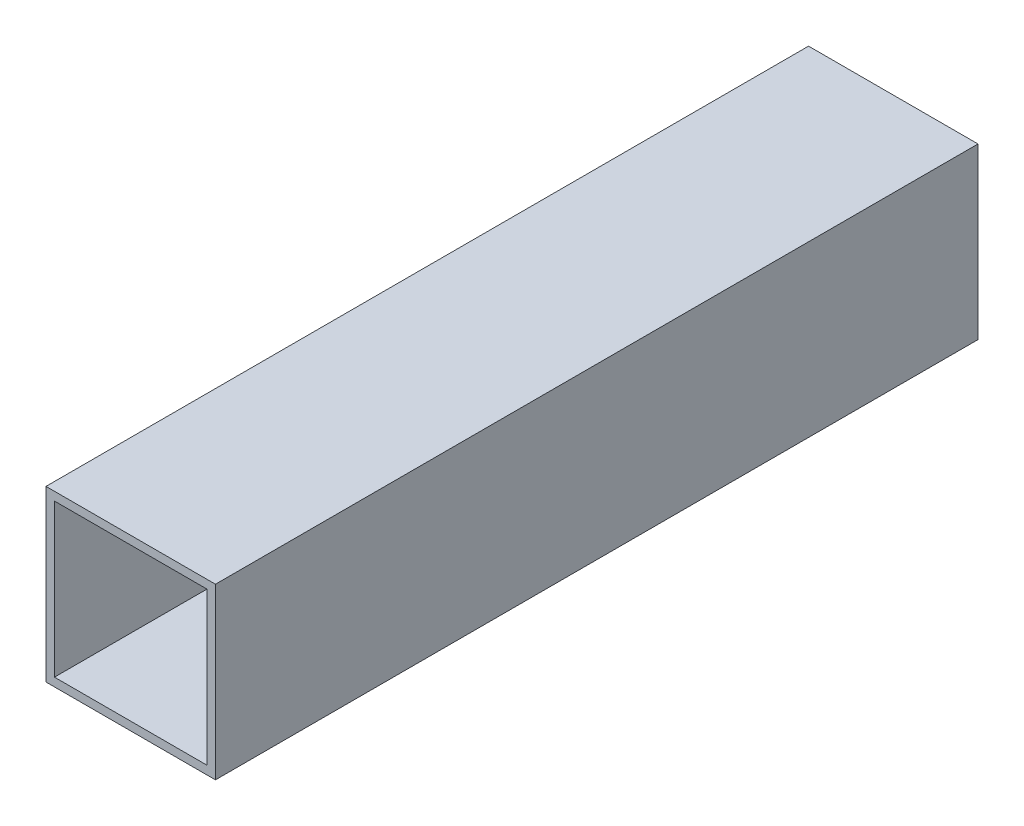
ISO-10303-21;
HEADER;
FILE_DESCRIPTION(('STEP AP214'),'2;1');
FILE_NAME('part.step','',(''),(''),'','','');
FILE_SCHEMA(('AUTOMOTIVE_DESIGN { 1 0 10303 214 1 1 1 1 }'));
ENDSEC;
DATA;
#1=APPLICATION_CONTEXT('core data for automotive mechanical design processes');
#2=APPLICATION_PROTOCOL_DEFINITION('international standard','automotive_design',2000,#1);
#3=PRODUCT_CONTEXT('',#1,'mechanical');
#4=PRODUCT('Part','Part','',(#3));
#5=PRODUCT_RELATED_PRODUCT_CATEGORY('part','',(#4));
#6=PRODUCT_DEFINITION_FORMATION('','',#4);
#7=PRODUCT_DEFINITION_CONTEXT('part definition',#1,'design');
#8=PRODUCT_DEFINITION('design','',#6,#7);
#9=PRODUCT_DEFINITION_SHAPE('','',#8);
#10=(LENGTH_UNIT() NAMED_UNIT(*) SI_UNIT(.MILLI.,.METRE.));
#11=(NAMED_UNIT(*) PLANE_ANGLE_UNIT() SI_UNIT($,.RADIAN.));
#12=(NAMED_UNIT(*) SI_UNIT($,.STERADIAN.) SOLID_ANGLE_UNIT());
#13=UNCERTAINTY_MEASURE_WITH_UNIT(LENGTH_MEASURE(1.E-05),#10,'distance_accuracy_value','');
#14=(GEOMETRIC_REPRESENTATION_CONTEXT(3) GLOBAL_UNCERTAINTY_ASSIGNED_CONTEXT((#13)) GLOBAL_UNIT_ASSIGNED_CONTEXT((#10,
#11,#12)) REPRESENTATION_CONTEXT('',''));
#15=CARTESIAN_POINT('',(0.,0.,0.));
#16=DIRECTION('',(0.,0.,1.));
#17=DIRECTION('',(1.,0.,0.));
#18=AXIS2_PLACEMENT_3D('',#15,#16,#17);
#19=CARTESIAN_POINT('',(0.,0.,225.));
#20=DIRECTION('',(0.,0.,-1.));
#21=DIRECTION('',(-1.,0.,0.));
#22=AXIS2_PLACEMENT_3D('',#19,#20,#21);
#23=PLANE('',#22);
#24=DIRECTION('',(0.,-1.,0.));
#25=VECTOR('',#24,1.);
#26=CARTESIAN_POINT('',(-50.,-50.,225.));
#27=LINE('',#26,#25);
#28=CARTESIAN_POINT('',(-50.,49.9999999999999,225.));
#29=VERTEX_POINT('',#28);
#30=CARTESIAN_POINT('',(-50.,-50.,225.));
#31=VERTEX_POINT('',#30);
#32=EDGE_CURVE('E149',#29,#31,#27,.T.);
#33=ORIENTED_EDGE('',*,*,#32,.T.);
#34=DIRECTION('',(1.,0.,0.));
#35=VECTOR('',#34,1.);
#36=CARTESIAN_POINT('',(-50.,-50.,225.));
#37=LINE('',#36,#35);
#38=CARTESIAN_POINT('',(50.,-50.,225.));
#39=VERTEX_POINT('',#38);
#40=EDGE_CURVE('E152',#31,#39,#37,.T.);
#41=ORIENTED_EDGE('',*,*,#40,.T.);
#42=DIRECTION('',(0.,1.,0.));
#43=VECTOR('',#42,1.);
#44=CARTESIAN_POINT('',(50.,-50.,225.));
#45=LINE('',#44,#43);
#46=CARTESIAN_POINT('',(49.9999999999999,49.9999999999999,225.));
#47=VERTEX_POINT('',#46);
#48=EDGE_CURVE('E155',#39,#47,#45,.T.);
#49=ORIENTED_EDGE('',*,*,#48,.T.);
#50=DIRECTION('',(-1.,0.,0.));
#51=VECTOR('',#50,1.);
#52=CARTESIAN_POINT('',(-50.,49.9999999999999,225.));
#53=LINE('',#52,#51);
#54=EDGE_CURVE('E158',#47,#29,#53,.T.);
#55=ORIENTED_EDGE('',*,*,#54,.T.);
#56=EDGE_LOOP('',(#33,#41,#49,#55));
#57=FACE_BOUND('',#56,.T.);
#58=DIRECTION('',(0.,-1.,0.));
#59=VECTOR('',#58,1.);
#60=CARTESIAN_POINT('',(-45.,-45.,225.));
#61=LINE('',#60,#59);
#62=CARTESIAN_POINT('',(-45.,44.9999999999999,225.));
#63=VERTEX_POINT('',#62);
#64=CARTESIAN_POINT('',(-45.,-45.,225.));
#65=VERTEX_POINT('',#64);
#66=EDGE_CURVE('E106',#63,#65,#61,.T.);
#67=ORIENTED_EDGE('',*,*,#66,.F.);
#68=DIRECTION('',(-1.,0.,0.));
#69=VECTOR('',#68,1.);
#70=CARTESIAN_POINT('',(-45.,44.9999999999999,225.));
#71=LINE('',#70,#69);
#72=CARTESIAN_POINT('',(45.,44.9999999999999,225.));
#73=VERTEX_POINT('',#72);
#74=EDGE_CURVE('E134',#73,#63,#71,.T.);
#75=ORIENTED_EDGE('',*,*,#74,.F.);
#76=DIRECTION('',(0.,1.,0.));
#77=VECTOR('',#76,1.);
#78=CARTESIAN_POINT('',(45.,-45.,225.));
#79=LINE('',#78,#77);
#80=CARTESIAN_POINT('',(45.,-45.,225.));
#81=VERTEX_POINT('',#80);
#82=EDGE_CURVE('E128',#81,#73,#79,.T.);
#83=ORIENTED_EDGE('',*,*,#82,.F.);
#84=DIRECTION('',(1.,0.,0.));
#85=VECTOR('',#84,1.);
#86=CARTESIAN_POINT('',(-45.,-45.,225.));
#87=LINE('',#86,#85);
#88=EDGE_CURVE('E115',#65,#81,#87,.T.);
#89=ORIENTED_EDGE('',*,*,#88,.F.);
#90=EDGE_LOOP('',(#67,#75,#83,#89));
#91=FACE_BOUND('',#90,.T.);
#92=ADVANCED_FACE('F37',(#57,#91),#23,.F.);
#93=CARTESIAN_POINT('',(0.,0.,-225.));
#94=DIRECTION('',(0.,0.,-1.));
#95=DIRECTION('',(-1.,0.,0.));
#96=AXIS2_PLACEMENT_3D('',#93,#94,#95);
#97=PLANE('',#96);
#98=DIRECTION('',(0.,-1.,0.));
#99=VECTOR('',#98,1.);
#100=CARTESIAN_POINT('',(-50.,-50.,-225.));
#101=LINE('',#100,#99);
#102=CARTESIAN_POINT('',(-50.,49.9999999999999,-225.));
#103=VERTEX_POINT('',#102);
#104=CARTESIAN_POINT('',(-50.,-50.,-225.));
#105=VERTEX_POINT('',#104);
#106=EDGE_CURVE('E124',#103,#105,#101,.T.);
#107=ORIENTED_EDGE('',*,*,#106,.F.);
#108=DIRECTION('',(-1.,0.,0.));
#109=VECTOR('',#108,1.);
#110=CARTESIAN_POINT('',(-50.,49.9999999999999,-225.));
#111=LINE('',#110,#109);
#112=CARTESIAN_POINT('',(49.9999999999999,49.9999999999999,-225.));
#113=VERTEX_POINT('',#112);
#114=EDGE_CURVE('E153',#113,#103,#111,.T.);
#115=ORIENTED_EDGE('',*,*,#114,.F.);
#116=DIRECTION('',(0.,1.,0.));
#117=VECTOR('',#116,1.);
#118=CARTESIAN_POINT('',(50.,-50.,-225.));
#119=LINE('',#118,#117);
#120=CARTESIAN_POINT('',(50.,-50.,-225.));
#121=VERTEX_POINT('',#120);
#122=EDGE_CURVE('E165',#121,#113,#119,.T.);
#123=ORIENTED_EDGE('',*,*,#122,.F.);
#124=DIRECTION('',(1.,0.,0.));
#125=VECTOR('',#124,1.);
#126=CARTESIAN_POINT('',(-50.,-50.,-225.));
#127=LINE('',#126,#125);
#128=EDGE_CURVE('E163',#105,#121,#127,.T.);
#129=ORIENTED_EDGE('',*,*,#128,.F.);
#130=EDGE_LOOP('',(#107,#115,#123,#129));
#131=FACE_BOUND('',#130,.T.);
#132=DIRECTION('',(-1.,0.,0.));
#133=VECTOR('',#132,1.);
#134=CARTESIAN_POINT('',(-45.,44.9999999999999,-225.));
#135=LINE('',#134,#133);
#136=CARTESIAN_POINT('',(45.,44.9999999999999,-225.));
#137=VERTEX_POINT('',#136);
#138=CARTESIAN_POINT('',(-45.,44.9999999999999,-225.));
#139=VERTEX_POINT('',#138);
#140=EDGE_CURVE('E116',#137,#139,#135,.T.);
#141=ORIENTED_EDGE('',*,*,#140,.T.);
#142=DIRECTION('',(0.,-1.,0.));
#143=VECTOR('',#142,1.);
#144=CARTESIAN_POINT('',(-45.,-45.,-225.));
#145=LINE('',#144,#143);
#146=CARTESIAN_POINT('',(-45.,-45.,-225.));
#147=VERTEX_POINT('',#146);
#148=EDGE_CURVE('E61',#139,#147,#145,.T.);
#149=ORIENTED_EDGE('',*,*,#148,.T.);
#150=DIRECTION('',(1.,0.,0.));
#151=VECTOR('',#150,1.);
#152=CARTESIAN_POINT('',(-45.,-45.,-225.));
#153=LINE('',#152,#151);
#154=CARTESIAN_POINT('',(45.,-45.,-225.));
#155=VERTEX_POINT('',#154);
#156=EDGE_CURVE('E122',#147,#155,#153,.T.);
#157=ORIENTED_EDGE('',*,*,#156,.T.);
#158=DIRECTION('',(0.,1.,0.));
#159=VECTOR('',#158,1.);
#160=CARTESIAN_POINT('',(45.,-45.,-225.));
#161=LINE('',#160,#159);
#162=EDGE_CURVE('E140',#155,#137,#161,.T.);
#163=ORIENTED_EDGE('',*,*,#162,.T.);
#164=EDGE_LOOP('',(#141,#149,#157,#163));
#165=FACE_BOUND('',#164,.T.);
#166=ADVANCED_FACE('F184',(#131,#165),#97,.T.);
#167=CARTESIAN_POINT('',(-50.,-50.,225.));
#168=DIRECTION('',(1.,0.,0.));
#169=DIRECTION('',(0.,0.,-1.));
#170=AXIS2_PLACEMENT_3D('',#167,#168,#169);
#171=PLANE('',#170);
#172=ORIENTED_EDGE('',*,*,#106,.T.);
#173=DIRECTION('',(0.,0.,-1.));
#174=VECTOR('',#173,1.);
#175=CARTESIAN_POINT('',(-50.,-50.,225.));
#176=LINE('',#175,#174);
#177=EDGE_CURVE('E11',#31,#105,#176,.T.);
#178=ORIENTED_EDGE('',*,*,#177,.F.);
#179=ORIENTED_EDGE('',*,*,#32,.F.);
#180=DIRECTION('',(0.,0.,-1.));
#181=VECTOR('',#180,1.);
#182=CARTESIAN_POINT('',(-50.,49.9999999999999,225.));
#183=LINE('',#182,#181);
#184=EDGE_CURVE('E160',#29,#103,#183,.T.);
#185=ORIENTED_EDGE('',*,*,#184,.T.);
#186=EDGE_LOOP('',(#172,#178,#179,#185));
#187=FACE_BOUND('',#186,.T.);
#188=ADVANCED_FACE('F39',(#187),#171,.F.);
#189=CARTESIAN_POINT('',(-50.,-50.,225.));
#190=DIRECTION('',(0.,1.,0.));
#191=DIRECTION('',(0.,0.,1.));
#192=AXIS2_PLACEMENT_3D('',#189,#190,#191);
#193=PLANE('',#192);
#194=ORIENTED_EDGE('',*,*,#128,.T.);
#195=DIRECTION('',(0.,0.,-1.));
#196=VECTOR('',#195,1.);
#197=CARTESIAN_POINT('',(50.,-50.,225.));
#198=LINE('',#197,#196);
#199=EDGE_CURVE('E46',#39,#121,#198,.T.);
#200=ORIENTED_EDGE('',*,*,#199,.F.);
#201=ORIENTED_EDGE('',*,*,#40,.F.);
#202=ORIENTED_EDGE('',*,*,#177,.T.);
#203=EDGE_LOOP('',(#194,#200,#201,#202));
#204=FACE_BOUND('',#203,.T.);
#205=ADVANCED_FACE('F194',(#204),#193,.F.);
#206=CARTESIAN_POINT('',(50.,-50.,225.));
#207=DIRECTION('',(-1.,0.,0.));
#208=DIRECTION('',(0.,-1.,0.));
#209=AXIS2_PLACEMENT_3D('',#206,#207,#208);
#210=PLANE('',#209);
#211=ORIENTED_EDGE('',*,*,#122,.T.);
#212=DIRECTION('',(0.,0.,-1.));
#213=VECTOR('',#212,1.);
#214=CARTESIAN_POINT('',(49.9999999999999,49.9999999999999,225.));
#215=LINE('',#214,#213);
#216=EDGE_CURVE('E170',#47,#113,#215,.T.);
#217=ORIENTED_EDGE('',*,*,#216,.F.);
#218=ORIENTED_EDGE('',*,*,#48,.F.);
#219=ORIENTED_EDGE('',*,*,#199,.T.);
#220=EDGE_LOOP('',(#211,#217,#218,#219));
#221=FACE_BOUND('',#220,.T.);
#222=ADVANCED_FACE('F178',(#221),#210,.F.);
#223=CARTESIAN_POINT('',(-50.,49.9999999999999,225.));
#224=DIRECTION('',(0.,-1.,0.));
#225=DIRECTION('',(0.,0.,-1.));
#226=AXIS2_PLACEMENT_3D('',#223,#224,#225);
#227=PLANE('',#226);
#228=ORIENTED_EDGE('',*,*,#114,.T.);
#229=ORIENTED_EDGE('',*,*,#184,.F.);
#230=ORIENTED_EDGE('',*,*,#54,.F.);
#231=ORIENTED_EDGE('',*,*,#216,.T.);
#232=EDGE_LOOP('',(#228,#229,#230,#231));
#233=FACE_BOUND('',#232,.T.);
#234=ADVANCED_FACE('F188',(#233),#227,.F.);
#235=CARTESIAN_POINT('',(-45.,-45.,225.));
#236=DIRECTION('',(1.,0.,0.));
#237=DIRECTION('',(0.,0.,-1.));
#238=AXIS2_PLACEMENT_3D('',#235,#236,#237);
#239=PLANE('',#238);
#240=ORIENTED_EDGE('',*,*,#148,.F.);
#241=DIRECTION('',(0.,0.,-1.));
#242=VECTOR('',#241,1.);
#243=CARTESIAN_POINT('',(-45.,44.9999999999999,225.));
#244=LINE('',#243,#242);
#245=EDGE_CURVE('E110',#63,#139,#244,.T.);
#246=ORIENTED_EDGE('',*,*,#245,.F.);
#247=ORIENTED_EDGE('',*,*,#66,.T.);
#248=DIRECTION('',(0.,0.,-1.));
#249=VECTOR('',#248,1.);
#250=CARTESIAN_POINT('',(-45.,-45.,225.));
#251=LINE('',#250,#249);
#252=EDGE_CURVE('E109',#65,#147,#251,.T.);
#253=ORIENTED_EDGE('',*,*,#252,.T.);
#254=EDGE_LOOP('',(#240,#246,#247,#253));
#255=FACE_BOUND('',#254,.T.);
#256=ADVANCED_FACE('F108',(#255),#239,.T.);
#257=CARTESIAN_POINT('',(-45.,-45.,225.));
#258=DIRECTION('',(0.,1.,0.));
#259=DIRECTION('',(0.,0.,1.));
#260=AXIS2_PLACEMENT_3D('',#257,#258,#259);
#261=PLANE('',#260);
#262=ORIENTED_EDGE('',*,*,#156,.F.);
#263=ORIENTED_EDGE('',*,*,#252,.F.);
#264=ORIENTED_EDGE('',*,*,#88,.T.);
#265=DIRECTION('',(0.,0.,-1.));
#266=VECTOR('',#265,1.);
#267=CARTESIAN_POINT('',(45.,-45.,225.));
#268=LINE('',#267,#266);
#269=EDGE_CURVE('E125',#81,#155,#268,.T.);
#270=ORIENTED_EDGE('',*,*,#269,.T.);
#271=EDGE_LOOP('',(#262,#263,#264,#270));
#272=FACE_BOUND('',#271,.T.);
#273=ADVANCED_FACE('F119',(#272),#261,.T.);
#274=CARTESIAN_POINT('',(45.,-45.,225.));
#275=DIRECTION('',(-1.,0.,0.));
#276=DIRECTION('',(0.,-1.,0.));
#277=AXIS2_PLACEMENT_3D('',#274,#275,#276);
#278=PLANE('',#277);
#279=ORIENTED_EDGE('',*,*,#162,.F.);
#280=ORIENTED_EDGE('',*,*,#269,.F.);
#281=ORIENTED_EDGE('',*,*,#82,.T.);
#282=DIRECTION('',(0.,0.,-1.));
#283=VECTOR('',#282,1.);
#284=CARTESIAN_POINT('',(45.,44.9999999999999,225.));
#285=LINE('',#284,#283);
#286=EDGE_CURVE('E53',#73,#137,#285,.T.);
#287=ORIENTED_EDGE('',*,*,#286,.T.);
#288=EDGE_LOOP('',(#279,#280,#281,#287));
#289=FACE_BOUND('',#288,.T.);
#290=ADVANCED_FACE('F217',(#289),#278,.T.);
#291=CARTESIAN_POINT('',(-45.,44.9999999999999,225.));
#292=DIRECTION('',(0.,-1.,0.));
#293=DIRECTION('',(0.,0.,-1.));
#294=AXIS2_PLACEMENT_3D('',#291,#292,#293);
#295=PLANE('',#294);
#296=ORIENTED_EDGE('',*,*,#140,.F.);
#297=ORIENTED_EDGE('',*,*,#286,.F.);
#298=ORIENTED_EDGE('',*,*,#74,.T.);
#299=ORIENTED_EDGE('',*,*,#245,.T.);
#300=EDGE_LOOP('',(#296,#297,#298,#299));
#301=FACE_BOUND('',#300,.T.);
#302=ADVANCED_FACE('F221',(#301),#295,.T.);
#303=CLOSED_SHELL('',(#92,#166,#188,#205,#222,#234,#256,#273,#290,#302));
#304=MANIFOLD_SOLID_BREP('B2',#303);
#305=ADVANCED_BREP_SHAPE_REPRESENTATION('',(#18,#304),#14);
#306=SHAPE_DEFINITION_REPRESENTATION(#9,#305);
ENDSEC;
END-ISO-10303-21;
